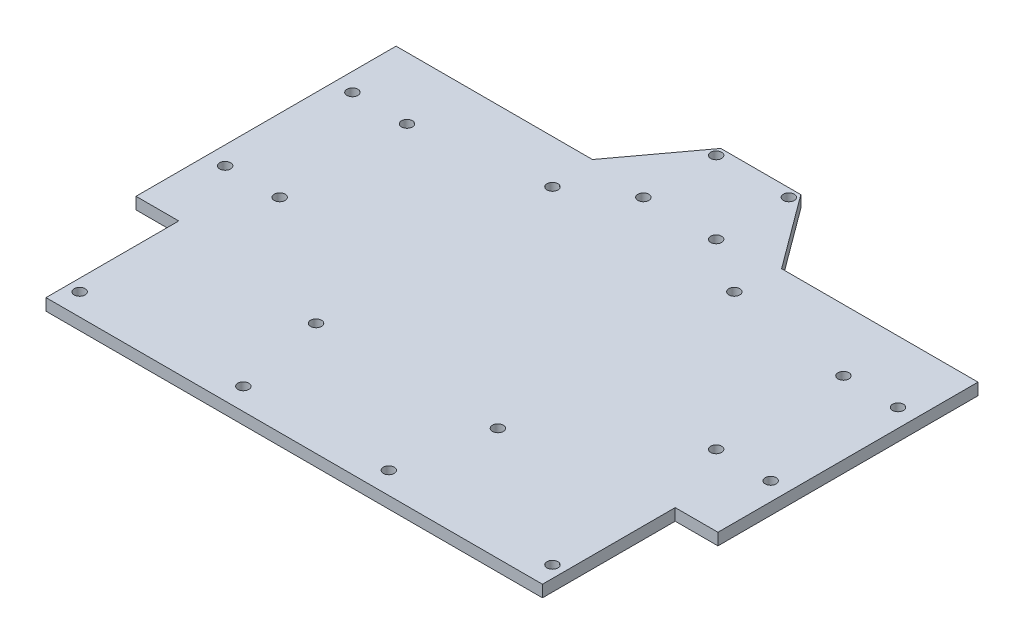
ISO-10303-21;
HEADER;
FILE_DESCRIPTION(('STEP AP214'),'2;1');
FILE_NAME('part.step','',(''),(''),'','','');
FILE_SCHEMA(('AUTOMOTIVE_DESIGN { 1 0 10303 214 1 1 1 1 }'));
ENDSEC;
DATA;
#1=APPLICATION_CONTEXT('core data for automotive mechanical design processes');
#2=APPLICATION_PROTOCOL_DEFINITION('international standard','automotive_design',2000,#1);
#3=PRODUCT_CONTEXT('',#1,'mechanical');
#4=PRODUCT('Part','Part','',(#3));
#5=PRODUCT_RELATED_PRODUCT_CATEGORY('part','',(#4));
#6=PRODUCT_DEFINITION_FORMATION('','',#4);
#7=PRODUCT_DEFINITION_CONTEXT('part definition',#1,'design');
#8=PRODUCT_DEFINITION('design','',#6,#7);
#9=PRODUCT_DEFINITION_SHAPE('','',#8);
#10=(LENGTH_UNIT() NAMED_UNIT(*) SI_UNIT(.MILLI.,.METRE.));
#11=(NAMED_UNIT(*) PLANE_ANGLE_UNIT() SI_UNIT($,.RADIAN.));
#12=(NAMED_UNIT(*) SI_UNIT($,.STERADIAN.) SOLID_ANGLE_UNIT());
#13=UNCERTAINTY_MEASURE_WITH_UNIT(LENGTH_MEASURE(1.E-05),#10,'distance_accuracy_value','');
#14=(GEOMETRIC_REPRESENTATION_CONTEXT(3) GLOBAL_UNCERTAINTY_ASSIGNED_CONTEXT((#13)) GLOBAL_UNIT_ASSIGNED_CONTEXT((#10,
#11,#12)) REPRESENTATION_CONTEXT('',''));
#15=CARTESIAN_POINT('',(0.,0.,0.));
#16=DIRECTION('',(0.,0.,1.));
#17=DIRECTION('',(1.,0.,0.));
#18=AXIS2_PLACEMENT_3D('',#15,#16,#17);
#19=CARTESIAN_POINT('',(0.,3.25,-35.75));
#20=DIRECTION('',(0.,0.,-1.));
#21=DIRECTION('',(-1.,0.,0.));
#22=AXIS2_PLACEMENT_3D('',#19,#20,#21);
#23=PLANE('',#22);
#24=DIRECTION('',(1.,0.,0.));
#25=VECTOR('',#24,1.);
#26=CARTESIAN_POINT('',(0.,0.,-35.75));
#27=LINE('',#26,#25);
#28=CARTESIAN_POINT('',(26.,0.,-35.75));
#29=VERTEX_POINT('',#28);
#30=CARTESIAN_POINT('',(80.,0.,-35.75));
#31=VERTEX_POINT('',#30);
#32=EDGE_CURVE('E185',#29,#31,#27,.T.);
#33=ORIENTED_EDGE('',*,*,#32,.F.);
#34=DIRECTION('',(0.,-1.,0.));
#35=VECTOR('',#34,1.);
#36=CARTESIAN_POINT('',(26.,3.25,-35.75));
#37=LINE('',#36,#35);
#38=CARTESIAN_POINT('',(26.,3.25,-35.75));
#39=VERTEX_POINT('',#38);
#40=EDGE_CURVE('E11',#39,#29,#37,.T.);
#41=ORIENTED_EDGE('',*,*,#40,.F.);
#42=DIRECTION('',(1.,0.,0.));
#43=VECTOR('',#42,1.);
#44=CARTESIAN_POINT('',(0.,3.25,-35.75));
#45=LINE('',#44,#43);
#46=CARTESIAN_POINT('',(80.,3.25,-35.75));
#47=VERTEX_POINT('',#46);
#48=EDGE_CURVE('E688',#39,#47,#45,.T.);
#49=ORIENTED_EDGE('',*,*,#48,.T.);
#50=DIRECTION('',(0.,-1.,0.));
#51=VECTOR('',#50,1.);
#52=CARTESIAN_POINT('',(80.,3.25,-35.75));
#53=LINE('',#52,#51);
#54=EDGE_CURVE('E54',#47,#31,#53,.T.);
#55=ORIENTED_EDGE('',*,*,#54,.T.);
#56=EDGE_LOOP('',(#33,#41,#49,#55));
#57=FACE_BOUND('',#56,.T.);
#58=ADVANCED_FACE('F37',(#57),#23,.T.);
#59=CARTESIAN_POINT('',(33.8998168733713,3.25,-25.0661945919675));
#60=DIRECTION('',(0.804064926863355,0.,-0.594541498457616));
#61=DIRECTION('',(-0.594541498457616,0.,-0.804064926863355));
#62=AXIS2_PLACEMENT_3D('',#59,#60,#61);
#63=PLANE('',#62);
#64=DIRECTION('',(0.594541498457616,0.,0.804064926863355));
#65=VECTOR('',#64,1.);
#66=CARTESIAN_POINT('',(33.8998168733713,0.,-25.0661945919675));
#67=LINE('',#66,#65);
#68=CARTESIAN_POINT('',(11.,0.,-56.0361767164099));
#69=VERTEX_POINT('',#68);
#70=EDGE_CURVE('E182',#69,#29,#67,.T.);
#71=ORIENTED_EDGE('',*,*,#70,.F.);
#72=DIRECTION('',(0.,-1.,0.));
#73=VECTOR('',#72,1.);
#74=CARTESIAN_POINT('',(11.,3.25,-56.0361767164099));
#75=LINE('',#74,#73);
#76=CARTESIAN_POINT('',(11.,3.25,-56.0361767164099));
#77=VERTEX_POINT('',#76);
#78=EDGE_CURVE('E46',#77,#69,#75,.T.);
#79=ORIENTED_EDGE('',*,*,#78,.F.);
#80=DIRECTION('',(0.594541498457616,0.,0.804064926863355));
#81=VECTOR('',#80,1.);
#82=CARTESIAN_POINT('',(33.8998168733713,3.25,-25.0661945919675));
#83=LINE('',#82,#81);
#84=EDGE_CURVE('E686',#77,#39,#83,.T.);
#85=ORIENTED_EDGE('',*,*,#84,.T.);
#86=ORIENTED_EDGE('',*,*,#40,.T.);
#87=EDGE_LOOP('',(#71,#79,#85,#86));
#88=FACE_BOUND('',#87,.T.);
#89=ADVANCED_FACE('F183',(#88),#63,.T.);
#90=CARTESIAN_POINT('',(0.,3.25,-56.0361767164099));
#91=DIRECTION('',(0.,0.,-1.));
#92=DIRECTION('',(-1.,0.,0.));
#93=AXIS2_PLACEMENT_3D('',#90,#91,#92);
#94=PLANE('',#93);
#95=DIRECTION('',(1.,0.,0.));
#96=VECTOR('',#95,1.);
#97=CARTESIAN_POINT('',(0.,0.,-56.0361767164099));
#98=LINE('',#97,#96);
#99=CARTESIAN_POINT('',(-11.,0.,-56.0361767164099));
#100=VERTEX_POINT('',#99);
#101=EDGE_CURVE('E174',#100,#69,#98,.T.);
#102=ORIENTED_EDGE('',*,*,#101,.F.);
#103=DIRECTION('',(0.,-1.,0.));
#104=VECTOR('',#103,1.);
#105=CARTESIAN_POINT('',(-11.,3.25,-56.0361767164099));
#106=LINE('',#105,#104);
#107=CARTESIAN_POINT('',(-11.,3.25,-56.0361767164099));
#108=VERTEX_POINT('',#107);
#109=EDGE_CURVE('E167',#108,#100,#106,.T.);
#110=ORIENTED_EDGE('',*,*,#109,.F.);
#111=DIRECTION('',(1.,0.,0.));
#112=VECTOR('',#111,1.);
#113=CARTESIAN_POINT('',(0.,3.25,-56.0361767164099));
#114=LINE('',#113,#112);
#115=EDGE_CURVE('E177',#108,#77,#114,.T.);
#116=ORIENTED_EDGE('',*,*,#115,.T.);
#117=ORIENTED_EDGE('',*,*,#78,.T.);
#118=EDGE_LOOP('',(#102,#110,#116,#117));
#119=FACE_BOUND('',#118,.T.);
#120=ADVANCED_FACE('F172',(#119),#94,.T.);
#121=CARTESIAN_POINT('',(-33.8998168733714,3.25,-25.0661945919675));
#122=DIRECTION('',(-0.804064926863356,0.,-0.594541498457615));
#123=DIRECTION('',(-0.594541498457615,0.,0.804064926863356));
#124=AXIS2_PLACEMENT_3D('',#121,#122,#123);
#125=PLANE('',#124);
#126=DIRECTION('',(0.594541498457615,0.,-0.804064926863356));
#127=VECTOR('',#126,1.);
#128=CARTESIAN_POINT('',(-33.8998168733714,0.,-25.0661945919675));
#129=LINE('',#128,#127);
#130=CARTESIAN_POINT('',(-26.,0.,-35.75));
#131=VERTEX_POINT('',#130);
#132=EDGE_CURVE('E190',#131,#100,#129,.T.);
#133=ORIENTED_EDGE('',*,*,#132,.F.);
#134=DIRECTION('',(0.,-1.,0.));
#135=VECTOR('',#134,1.);
#136=CARTESIAN_POINT('',(-26.,3.25,-35.75));
#137=LINE('',#136,#135);
#138=CARTESIAN_POINT('',(-26.,3.25,-35.75));
#139=VERTEX_POINT('',#138);
#140=EDGE_CURVE('E165',#139,#131,#137,.T.);
#141=ORIENTED_EDGE('',*,*,#140,.F.);
#142=DIRECTION('',(0.594541498457615,0.,-0.804064926863356));
#143=VECTOR('',#142,1.);
#144=CARTESIAN_POINT('',(-33.8998168733714,3.25,-25.0661945919675));
#145=LINE('',#144,#143);
#146=EDGE_CURVE('E670',#139,#108,#145,.T.);
#147=ORIENTED_EDGE('',*,*,#146,.T.);
#148=ORIENTED_EDGE('',*,*,#109,.T.);
#149=EDGE_LOOP('',(#133,#141,#147,#148));
#150=FACE_BOUND('',#149,.T.);
#151=ADVANCED_FACE('F629',(#150),#125,.T.);
#152=CARTESIAN_POINT('',(0.,3.25,-35.75));
#153=DIRECTION('',(0.,0.,-1.));
#154=DIRECTION('',(-1.,0.,0.));
#155=AXIS2_PLACEMENT_3D('',#152,#153,#154);
#156=PLANE('',#155);
#157=DIRECTION('',(1.,0.,0.));
#158=VECTOR('',#157,1.);
#159=CARTESIAN_POINT('',(0.,0.,-35.75));
#160=LINE('',#159,#158);
#161=CARTESIAN_POINT('',(-80.,0.,-35.75));
#162=VERTEX_POINT('',#161);
#163=EDGE_CURVE('E192',#162,#131,#160,.T.);
#164=ORIENTED_EDGE('',*,*,#163,.F.);
#165=DIRECTION('',(0.,-1.,0.));
#166=VECTOR('',#165,1.);
#167=CARTESIAN_POINT('',(-80.,3.25,-35.75));
#168=LINE('',#167,#166);
#169=CARTESIAN_POINT('',(-80.,3.25,-35.75));
#170=VERTEX_POINT('',#169);
#171=EDGE_CURVE('E163',#170,#162,#168,.T.);
#172=ORIENTED_EDGE('',*,*,#171,.F.);
#173=DIRECTION('',(1.,0.,0.));
#174=VECTOR('',#173,1.);
#175=CARTESIAN_POINT('',(0.,3.25,-35.75));
#176=LINE('',#175,#174);
#177=EDGE_CURVE('E667',#170,#139,#176,.T.);
#178=ORIENTED_EDGE('',*,*,#177,.T.);
#179=ORIENTED_EDGE('',*,*,#140,.T.);
#180=EDGE_LOOP('',(#164,#172,#178,#179));
#181=FACE_BOUND('',#180,.T.);
#182=ADVANCED_FACE('F619',(#181),#156,.T.);
#183=CARTESIAN_POINT('',(-80.,3.25,0.));
#184=DIRECTION('',(1.,0.,0.));
#185=DIRECTION('',(0.,0.,-1.));
#186=AXIS2_PLACEMENT_3D('',#183,#184,#185);
#187=PLANE('',#186);
#188=DIRECTION('',(0.,0.,1.));
#189=VECTOR('',#188,1.);
#190=CARTESIAN_POINT('',(-80.,0.,0.));
#191=LINE('',#190,#189);
#192=CARTESIAN_POINT('',(-80.,0.,35.75));
#193=VERTEX_POINT('',#192);
#194=EDGE_CURVE('E197',#162,#193,#191,.T.);
#195=ORIENTED_EDGE('',*,*,#194,.T.);
#196=DIRECTION('',(0.,-1.,0.));
#197=VECTOR('',#196,1.);
#198=CARTESIAN_POINT('',(-80.,3.25,35.75));
#199=LINE('',#198,#197);
#200=CARTESIAN_POINT('',(-80.,3.25,35.75));
#201=VERTEX_POINT('',#200);
#202=EDGE_CURVE('E160',#201,#193,#199,.T.);
#203=ORIENTED_EDGE('',*,*,#202,.F.);
#204=DIRECTION('',(0.,0.,1.));
#205=VECTOR('',#204,1.);
#206=CARTESIAN_POINT('',(-80.,3.25,0.));
#207=LINE('',#206,#205);
#208=EDGE_CURVE('E669',#170,#201,#207,.T.);
#209=ORIENTED_EDGE('',*,*,#208,.F.);
#210=ORIENTED_EDGE('',*,*,#171,.T.);
#211=EDGE_LOOP('',(#195,#203,#209,#210));
#212=FACE_BOUND('',#211,.T.);
#213=ADVANCED_FACE('F609',(#212),#187,.F.);
#214=CARTESIAN_POINT('',(0.,3.25,35.75));
#215=DIRECTION('',(0.,0.,-1.));
#216=DIRECTION('',(-1.,0.,0.));
#217=AXIS2_PLACEMENT_3D('',#214,#215,#216);
#218=PLANE('',#217);
#219=DIRECTION('',(1.,0.,0.));
#220=VECTOR('',#219,1.);
#221=CARTESIAN_POINT('',(0.,0.,35.75));
#222=LINE('',#221,#220);
#223=CARTESIAN_POINT('',(-68.25,0.,35.75));
#224=VERTEX_POINT('',#223);
#225=EDGE_CURVE('E200',#193,#224,#222,.T.);
#226=ORIENTED_EDGE('',*,*,#225,.T.);
#227=DIRECTION('',(0.,-1.,0.));
#228=VECTOR('',#227,1.);
#229=CARTESIAN_POINT('',(-68.25,3.25,35.75));
#230=LINE('',#229,#228);
#231=CARTESIAN_POINT('',(-68.25,3.25,35.75));
#232=VERTEX_POINT('',#231);
#233=EDGE_CURVE('E158',#232,#224,#230,.T.);
#234=ORIENTED_EDGE('',*,*,#233,.F.);
#235=DIRECTION('',(1.,0.,0.));
#236=VECTOR('',#235,1.);
#237=CARTESIAN_POINT('',(0.,3.25,35.75));
#238=LINE('',#237,#236);
#239=EDGE_CURVE('E672',#201,#232,#238,.T.);
#240=ORIENTED_EDGE('',*,*,#239,.F.);
#241=ORIENTED_EDGE('',*,*,#202,.T.);
#242=EDGE_LOOP('',(#226,#234,#240,#241));
#243=FACE_BOUND('',#242,.T.);
#244=ADVANCED_FACE('F599',(#243),#218,.F.);
#245=CARTESIAN_POINT('',(-68.25,3.25,0.));
#246=DIRECTION('',(-1.,0.,0.));
#247=DIRECTION('',(0.,0.,1.));
#248=AXIS2_PLACEMENT_3D('',#245,#246,#247);
#249=PLANE('',#248);
#250=DIRECTION('',(0.,0.,-1.));
#251=VECTOR('',#250,1.);
#252=CARTESIAN_POINT('',(-68.25,0.,0.));
#253=LINE('',#252,#251);
#254=CARTESIAN_POINT('',(-68.25,0.,72.25));
#255=VERTEX_POINT('',#254);
#256=EDGE_CURVE('E203',#255,#224,#253,.T.);
#257=ORIENTED_EDGE('',*,*,#256,.F.);
#258=DIRECTION('',(0.,-1.,0.));
#259=VECTOR('',#258,1.);
#260=CARTESIAN_POINT('',(-68.25,3.25,72.25));
#261=LINE('',#260,#259);
#262=CARTESIAN_POINT('',(-68.25,3.25,72.25));
#263=VERTEX_POINT('',#262);
#264=EDGE_CURVE('E152',#263,#255,#261,.T.);
#265=ORIENTED_EDGE('',*,*,#264,.F.);
#266=DIRECTION('',(0.,0.,-1.));
#267=VECTOR('',#266,1.);
#268=CARTESIAN_POINT('',(-68.25,3.25,0.));
#269=LINE('',#268,#267);
#270=EDGE_CURVE('E678',#263,#232,#269,.T.);
#271=ORIENTED_EDGE('',*,*,#270,.T.);
#272=ORIENTED_EDGE('',*,*,#233,.T.);
#273=EDGE_LOOP('',(#257,#265,#271,#272));
#274=FACE_BOUND('',#273,.T.);
#275=ADVANCED_FACE('F589',(#274),#249,.T.);
#276=CARTESIAN_POINT('',(0.,3.25,72.25));
#277=DIRECTION('',(0.,0.,-1.));
#278=DIRECTION('',(-1.,0.,0.));
#279=AXIS2_PLACEMENT_3D('',#276,#277,#278);
#280=PLANE('',#279);
#281=DIRECTION('',(1.,0.,0.));
#282=VECTOR('',#281,1.);
#283=CARTESIAN_POINT('',(0.,0.,72.25));
#284=LINE('',#283,#282);
#285=CARTESIAN_POINT('',(68.25,0.,72.25));
#286=VERTEX_POINT('',#285);
#287=EDGE_CURVE('E206',#255,#286,#284,.T.);
#288=ORIENTED_EDGE('',*,*,#287,.T.);
#289=DIRECTION('',(0.,-1.,0.));
#290=VECTOR('',#289,1.);
#291=CARTESIAN_POINT('',(68.25,3.25,72.25));
#292=LINE('',#291,#290);
#293=CARTESIAN_POINT('',(68.25,3.25,72.25));
#294=VERTEX_POINT('',#293);
#295=EDGE_CURVE('E150',#294,#286,#292,.T.);
#296=ORIENTED_EDGE('',*,*,#295,.F.);
#297=DIRECTION('',(1.,0.,0.));
#298=VECTOR('',#297,1.);
#299=CARTESIAN_POINT('',(0.,3.25,72.25));
#300=LINE('',#299,#298);
#301=EDGE_CURVE('E143',#263,#294,#300,.T.);
#302=ORIENTED_EDGE('',*,*,#301,.F.);
#303=ORIENTED_EDGE('',*,*,#264,.T.);
#304=EDGE_LOOP('',(#288,#296,#302,#303));
#305=FACE_BOUND('',#304,.T.);
#306=ADVANCED_FACE('F580',(#305),#280,.F.);
#307=CARTESIAN_POINT('',(68.25,3.25,0.));
#308=DIRECTION('',(-1.,0.,0.));
#309=DIRECTION('',(0.,0.,1.));
#310=AXIS2_PLACEMENT_3D('',#307,#308,#309);
#311=PLANE('',#310);
#312=DIRECTION('',(0.,0.,-1.));
#313=VECTOR('',#312,1.);
#314=CARTESIAN_POINT('',(68.25,0.,0.));
#315=LINE('',#314,#313);
#316=CARTESIAN_POINT('',(68.25,0.,35.75));
#317=VERTEX_POINT('',#316);
#318=EDGE_CURVE('E149',#286,#317,#315,.T.);
#319=ORIENTED_EDGE('',*,*,#318,.T.);
#320=DIRECTION('',(0.,-1.,0.));
#321=VECTOR('',#320,1.);
#322=CARTESIAN_POINT('',(68.25,3.25,35.75));
#323=LINE('',#322,#321);
#324=CARTESIAN_POINT('',(68.25,3.25,35.75));
#325=VERTEX_POINT('',#324);
#326=EDGE_CURVE('E132',#325,#317,#323,.T.);
#327=ORIENTED_EDGE('',*,*,#326,.F.);
#328=DIRECTION('',(0.,0.,-1.));
#329=VECTOR('',#328,1.);
#330=CARTESIAN_POINT('',(68.25,3.25,0.));
#331=LINE('',#330,#329);
#332=EDGE_CURVE('E137',#294,#325,#331,.T.);
#333=ORIENTED_EDGE('',*,*,#332,.F.);
#334=ORIENTED_EDGE('',*,*,#295,.T.);
#335=EDGE_LOOP('',(#319,#327,#333,#334));
#336=FACE_BOUND('',#335,.T.);
#337=ADVANCED_FACE('F148',(#336),#311,.F.);
#338=CARTESIAN_POINT('',(0.,3.25,35.75));
#339=DIRECTION('',(0.,0.,-1.));
#340=DIRECTION('',(-1.,0.,0.));
#341=AXIS2_PLACEMENT_3D('',#338,#339,#340);
#342=PLANE('',#341);
#343=DIRECTION('',(1.,0.,0.));
#344=VECTOR('',#343,1.);
#345=CARTESIAN_POINT('',(0.,0.,35.75));
#346=LINE('',#345,#344);
#347=CARTESIAN_POINT('',(80.,0.,35.75));
#348=VERTEX_POINT('',#347);
#349=EDGE_CURVE('E210',#317,#348,#346,.T.);
#350=ORIENTED_EDGE('',*,*,#349,.T.);
#351=DIRECTION('',(0.,-1.,0.));
#352=VECTOR('',#351,1.);
#353=CARTESIAN_POINT('',(80.,3.25,35.75));
#354=LINE('',#353,#352);
#355=CARTESIAN_POINT('',(80.,3.25,35.75));
#356=VERTEX_POINT('',#355);
#357=EDGE_CURVE('E92',#356,#348,#354,.T.);
#358=ORIENTED_EDGE('',*,*,#357,.F.);
#359=DIRECTION('',(1.,0.,0.));
#360=VECTOR('',#359,1.);
#361=CARTESIAN_POINT('',(0.,3.25,35.75));
#362=LINE('',#361,#360);
#363=EDGE_CURVE('E128',#325,#356,#362,.T.);
#364=ORIENTED_EDGE('',*,*,#363,.F.);
#365=ORIENTED_EDGE('',*,*,#326,.T.);
#366=EDGE_LOOP('',(#350,#358,#364,#365));
#367=FACE_BOUND('',#366,.T.);
#368=ADVANCED_FACE('F130',(#367),#342,.F.);
#369=CARTESIAN_POINT('',(-10.,3.25,-33.75));
#370=DIRECTION('',(0.,-1.,0.));
#371=DIRECTION('',(0.,0.,-1.));
#372=AXIS2_PLACEMENT_3D('',#369,#370,#371);
#373=CYLINDRICAL_SURFACE('',#372,1.50250000000001);
#374=CARTESIAN_POINT('',(-10.,3.25,-33.75));
#375=DIRECTION('',(0.,1.,0.));
#376=DIRECTION('',(0.,0.,1.));
#377=AXIS2_PLACEMENT_3D('',#374,#375,#376);
#378=CIRCLE('',#377,1.50250000000001);
#379=CARTESIAN_POINT('',(-10.,3.25,-32.2475));
#380=VERTEX_POINT('',#379);
#381=EDGE_CURVE('E690',#380,#380,#378,.T.);
#382=ORIENTED_EDGE('',*,*,#381,.T.);
#383=EDGE_LOOP('',(#382));
#384=FACE_BOUND('',#383,.T.);
#385=CARTESIAN_POINT('',(-10.,0.,-33.75));
#386=DIRECTION('',(0.,1.,0.));
#387=DIRECTION('',(0.,0.,1.));
#388=AXIS2_PLACEMENT_3D('',#385,#386,#387);
#389=CIRCLE('',#388,1.50250000000001);
#390=CARTESIAN_POINT('',(-10.,0.,-32.2475));
#391=VERTEX_POINT('',#390);
#392=EDGE_CURVE('E274',#391,#391,#389,.T.);
#393=ORIENTED_EDGE('',*,*,#392,.F.);
#394=EDGE_LOOP('',(#393));
#395=FACE_BOUND('',#394,.T.);
#396=ADVANCED_FACE('F297',(#384,#395),#373,.F.);
#397=CARTESIAN_POINT('',(9.99999999999999,3.25,-33.75));
#398=DIRECTION('',(0.,-1.,0.));
#399=DIRECTION('',(0.,0.,-1.));
#400=AXIS2_PLACEMENT_3D('',#397,#398,#399);
#401=CYLINDRICAL_SURFACE('',#400,1.50250000000001);
#402=CARTESIAN_POINT('',(9.99999999999999,3.25,-33.75));
#403=DIRECTION('',(0.,1.,0.));
#404=DIRECTION('',(0.,0.,1.));
#405=AXIS2_PLACEMENT_3D('',#402,#403,#404);
#406=CIRCLE('',#405,1.50250000000001);
#407=CARTESIAN_POINT('',(9.99999999999999,3.25,-32.2475));
#408=VERTEX_POINT('',#407);
#409=EDGE_CURVE('E693',#408,#408,#406,.T.);
#410=ORIENTED_EDGE('',*,*,#409,.T.);
#411=EDGE_LOOP('',(#410));
#412=FACE_BOUND('',#411,.T.);
#413=CARTESIAN_POINT('',(9.99999999999999,0.,-33.75));
#414=DIRECTION('',(0.,1.,0.));
#415=DIRECTION('',(0.,0.,1.));
#416=AXIS2_PLACEMENT_3D('',#413,#414,#415);
#417=CIRCLE('',#416,1.50250000000001);
#418=CARTESIAN_POINT('',(9.99999999999999,0.,-32.2475));
#419=VERTEX_POINT('',#418);
#420=EDGE_CURVE('E271',#419,#419,#417,.T.);
#421=ORIENTED_EDGE('',*,*,#420,.F.);
#422=EDGE_LOOP('',(#421));
#423=FACE_BOUND('',#422,.T.);
#424=ADVANCED_FACE('F300',(#412,#423),#401,.F.);
#425=CARTESIAN_POINT('',(-10.0000000000001,3.25,-53.75));
#426=DIRECTION('',(0.,-1.,0.));
#427=DIRECTION('',(0.,0.,-1.));
#428=AXIS2_PLACEMENT_3D('',#425,#426,#427);
#429=CYLINDRICAL_SURFACE('',#428,1.5025);
#430=CARTESIAN_POINT('',(-10.0000000000001,3.25,-53.75));
#431=DIRECTION('',(0.,1.,0.));
#432=DIRECTION('',(0.,0.,1.));
#433=AXIS2_PLACEMENT_3D('',#430,#431,#432);
#434=CIRCLE('',#433,1.5025);
#435=CARTESIAN_POINT('',(-10.0000000000001,3.25,-52.2475));
#436=VERTEX_POINT('',#435);
#437=EDGE_CURVE('E696',#436,#436,#434,.T.);
#438=ORIENTED_EDGE('',*,*,#437,.T.);
#439=EDGE_LOOP('',(#438));
#440=FACE_BOUND('',#439,.T.);
#441=CARTESIAN_POINT('',(-10.0000000000001,0.,-53.75));
#442=DIRECTION('',(0.,1.,0.));
#443=DIRECTION('',(0.,0.,1.));
#444=AXIS2_PLACEMENT_3D('',#441,#442,#443);
#445=CIRCLE('',#444,1.5025);
#446=CARTESIAN_POINT('',(-10.0000000000001,0.,-52.2475));
#447=VERTEX_POINT('',#446);
#448=EDGE_CURVE('E268',#447,#447,#445,.T.);
#449=ORIENTED_EDGE('',*,*,#448,.F.);
#450=EDGE_LOOP('',(#449));
#451=FACE_BOUND('',#450,.T.);
#452=ADVANCED_FACE('F304',(#440,#451),#429,.F.);
#453=CARTESIAN_POINT('',(9.99999999999993,3.25,-53.75));
#454=DIRECTION('',(0.,-1.,0.));
#455=DIRECTION('',(0.,0.,-1.));
#456=AXIS2_PLACEMENT_3D('',#453,#454,#455);
#457=CYLINDRICAL_SURFACE('',#456,1.5025);
#458=CARTESIAN_POINT('',(9.99999999999993,3.25,-53.75));
#459=DIRECTION('',(0.,1.,0.));
#460=DIRECTION('',(0.,0.,1.));
#461=AXIS2_PLACEMENT_3D('',#458,#459,#460);
#462=CIRCLE('',#461,1.5025);
#463=CARTESIAN_POINT('',(9.99999999999993,3.25,-52.2475));
#464=VERTEX_POINT('',#463);
#465=EDGE_CURVE('E699',#464,#464,#462,.T.);
#466=ORIENTED_EDGE('',*,*,#465,.T.);
#467=EDGE_LOOP('',(#466));
#468=FACE_BOUND('',#467,.T.);
#469=CARTESIAN_POINT('',(9.99999999999993,0.,-53.75));
#470=DIRECTION('',(0.,1.,0.));
#471=DIRECTION('',(0.,0.,1.));
#472=AXIS2_PLACEMENT_3D('',#469,#470,#471);
#473=CIRCLE('',#472,1.5025);
#474=CARTESIAN_POINT('',(9.99999999999993,0.,-52.2475));
#475=VERTEX_POINT('',#474);
#476=EDGE_CURVE('E265',#475,#475,#473,.T.);
#477=ORIENTED_EDGE('',*,*,#476,.F.);
#478=EDGE_LOOP('',(#477));
#479=FACE_BOUND('',#478,.T.);
#480=ADVANCED_FACE('F308',(#468,#479),#457,.F.);
#481=CARTESIAN_POINT('',(-25.,3.25,-23.75));
#482=DIRECTION('',(0.,-1.,0.));
#483=DIRECTION('',(0.,0.,-1.));
#484=AXIS2_PLACEMENT_3D('',#481,#482,#483);
#485=CYLINDRICAL_SURFACE('',#484,1.50250000000001);
#486=CARTESIAN_POINT('',(-25.,3.25,-23.75));
#487=DIRECTION('',(0.,1.,0.));
#488=DIRECTION('',(0.,0.,1.));
#489=AXIS2_PLACEMENT_3D('',#486,#487,#488);
#490=CIRCLE('',#489,1.50250000000001);
#491=CARTESIAN_POINT('',(-25.,3.25,-22.2475));
#492=VERTEX_POINT('',#491);
#493=EDGE_CURVE('E702',#492,#492,#490,.T.);
#494=ORIENTED_EDGE('',*,*,#493,.T.);
#495=EDGE_LOOP('',(#494));
#496=FACE_BOUND('',#495,.T.);
#497=CARTESIAN_POINT('',(-25.,0.,-23.75));
#498=DIRECTION('',(0.,1.,0.));
#499=DIRECTION('',(0.,0.,1.));
#500=AXIS2_PLACEMENT_3D('',#497,#498,#499);
#501=CIRCLE('',#500,1.50250000000001);
#502=CARTESIAN_POINT('',(-25.,0.,-22.2475));
#503=VERTEX_POINT('',#502);
#504=EDGE_CURVE('E262',#503,#503,#501,.T.);
#505=ORIENTED_EDGE('',*,*,#504,.F.);
#506=EDGE_LOOP('',(#505));
#507=FACE_BOUND('',#506,.T.);
#508=ADVANCED_FACE('F312',(#496,#507),#485,.F.);
#509=CARTESIAN_POINT('',(25.,3.25,-23.75));
#510=DIRECTION('',(0.,-1.,0.));
#511=DIRECTION('',(0.,0.,-1.));
#512=AXIS2_PLACEMENT_3D('',#509,#510,#511);
#513=CYLINDRICAL_SURFACE('',#512,1.50250000000001);
#514=CARTESIAN_POINT('',(25.,3.25,-23.75));
#515=DIRECTION('',(0.,1.,0.));
#516=DIRECTION('',(0.,0.,1.));
#517=AXIS2_PLACEMENT_3D('',#514,#515,#516);
#518=CIRCLE('',#517,1.50250000000001);
#519=CARTESIAN_POINT('',(25.,3.25,-22.2475));
#520=VERTEX_POINT('',#519);
#521=EDGE_CURVE('E705',#520,#520,#518,.T.);
#522=ORIENTED_EDGE('',*,*,#521,.T.);
#523=EDGE_LOOP('',(#522));
#524=FACE_BOUND('',#523,.T.);
#525=CARTESIAN_POINT('',(25.,0.,-23.75));
#526=DIRECTION('',(0.,1.,0.));
#527=DIRECTION('',(0.,0.,1.));
#528=AXIS2_PLACEMENT_3D('',#525,#526,#527);
#529=CIRCLE('',#528,1.50250000000001);
#530=CARTESIAN_POINT('',(25.,0.,-22.2475));
#531=VERTEX_POINT('',#530);
#532=EDGE_CURVE('E259',#531,#531,#529,.T.);
#533=ORIENTED_EDGE('',*,*,#532,.F.);
#534=EDGE_LOOP('',(#533));
#535=FACE_BOUND('',#534,.T.);
#536=ADVANCED_FACE('F316',(#524,#535),#513,.F.);
#537=CARTESIAN_POINT('',(-59.9999999999999,3.25,-18.75));
#538=DIRECTION('',(0.,-1.,0.));
#539=DIRECTION('',(0.,0.,-1.));
#540=AXIS2_PLACEMENT_3D('',#537,#538,#539);
#541=CYLINDRICAL_SURFACE('',#540,1.50250000000001);
#542=CARTESIAN_POINT('',(-59.9999999999999,3.25,-18.75));
#543=DIRECTION('',(0.,1.,0.));
#544=DIRECTION('',(0.,0.,1.));
#545=AXIS2_PLACEMENT_3D('',#542,#543,#544);
#546=CIRCLE('',#545,1.50250000000001);
#547=CARTESIAN_POINT('',(-59.9999999999999,3.25,-17.2475));
#548=VERTEX_POINT('',#547);
#549=EDGE_CURVE('E708',#548,#548,#546,.T.);
#550=ORIENTED_EDGE('',*,*,#549,.T.);
#551=EDGE_LOOP('',(#550));
#552=FACE_BOUND('',#551,.T.);
#553=CARTESIAN_POINT('',(-59.9999999999999,0.,-18.75));
#554=DIRECTION('',(0.,1.,0.));
#555=DIRECTION('',(0.,0.,1.));
#556=AXIS2_PLACEMENT_3D('',#553,#554,#555);
#557=CIRCLE('',#556,1.50250000000001);
#558=CARTESIAN_POINT('',(-59.9999999999999,0.,-17.2475));
#559=VERTEX_POINT('',#558);
#560=EDGE_CURVE('E256',#559,#559,#557,.T.);
#561=ORIENTED_EDGE('',*,*,#560,.F.);
#562=EDGE_LOOP('',(#561));
#563=FACE_BOUND('',#562,.T.);
#564=ADVANCED_FACE('F320',(#552,#563),#541,.F.);
#565=CARTESIAN_POINT('',(60.0000000000001,3.25,-18.75));
#566=DIRECTION('',(0.,-1.,0.));
#567=DIRECTION('',(0.,0.,-1.));
#568=AXIS2_PLACEMENT_3D('',#565,#566,#567);
#569=CYLINDRICAL_SURFACE('',#568,1.50250000000001);
#570=CARTESIAN_POINT('',(60.0000000000001,3.25,-18.75));
#571=DIRECTION('',(0.,1.,0.));
#572=DIRECTION('',(0.,0.,1.));
#573=AXIS2_PLACEMENT_3D('',#570,#571,#572);
#574=CIRCLE('',#573,1.50250000000001);
#575=CARTESIAN_POINT('',(60.0000000000001,3.25,-17.2475));
#576=VERTEX_POINT('',#575);
#577=EDGE_CURVE('E711',#576,#576,#574,.T.);
#578=ORIENTED_EDGE('',*,*,#577,.T.);
#579=EDGE_LOOP('',(#578));
#580=FACE_BOUND('',#579,.T.);
#581=CARTESIAN_POINT('',(60.0000000000001,0.,-18.75));
#582=DIRECTION('',(0.,1.,0.));
#583=DIRECTION('',(0.,0.,1.));
#584=AXIS2_PLACEMENT_3D('',#581,#582,#583);
#585=CIRCLE('',#584,1.50250000000001);
#586=CARTESIAN_POINT('',(60.0000000000001,0.,-17.2475));
#587=VERTEX_POINT('',#586);
#588=EDGE_CURVE('E253',#587,#587,#585,.T.);
#589=ORIENTED_EDGE('',*,*,#588,.F.);
#590=EDGE_LOOP('',(#589));
#591=FACE_BOUND('',#590,.T.);
#592=ADVANCED_FACE('F324',(#580,#591),#569,.F.);
#593=CARTESIAN_POINT('',(75.0000000000001,3.25,-18.75));
#594=DIRECTION('',(0.,-1.,0.));
#595=DIRECTION('',(0.,0.,-1.));
#596=AXIS2_PLACEMENT_3D('',#593,#594,#595);
#597=CYLINDRICAL_SURFACE('',#596,1.50250000000001);
#598=CARTESIAN_POINT('',(75.0000000000001,3.25,-18.75));
#599=DIRECTION('',(0.,1.,0.));
#600=DIRECTION('',(0.,0.,1.));
#601=AXIS2_PLACEMENT_3D('',#598,#599,#600);
#602=CIRCLE('',#601,1.50250000000001);
#603=CARTESIAN_POINT('',(75.0000000000001,3.25,-17.2475));
#604=VERTEX_POINT('',#603);
#605=EDGE_CURVE('E714',#604,#604,#602,.T.);
#606=ORIENTED_EDGE('',*,*,#605,.T.);
#607=EDGE_LOOP('',(#606));
#608=FACE_BOUND('',#607,.T.);
#609=CARTESIAN_POINT('',(75.0000000000001,0.,-18.75));
#610=DIRECTION('',(0.,1.,0.));
#611=DIRECTION('',(0.,0.,1.));
#612=AXIS2_PLACEMENT_3D('',#609,#610,#611);
#613=CIRCLE('',#612,1.50250000000001);
#614=CARTESIAN_POINT('',(75.0000000000001,0.,-17.2475));
#615=VERTEX_POINT('',#614);
#616=EDGE_CURVE('E250',#615,#615,#613,.T.);
#617=ORIENTED_EDGE('',*,*,#616,.F.);
#618=EDGE_LOOP('',(#617));
#619=FACE_BOUND('',#618,.T.);
#620=ADVANCED_FACE('F328',(#608,#619),#597,.F.);
#621=CARTESIAN_POINT('',(-59.9999999999995,3.25,16.25));
#622=DIRECTION('',(0.,-1.,0.));
#623=DIRECTION('',(0.,0.,-1.));
#624=AXIS2_PLACEMENT_3D('',#621,#622,#623);
#625=CYLINDRICAL_SURFACE('',#624,1.50250000000001);
#626=CARTESIAN_POINT('',(-59.9999999999995,3.25,16.25));
#627=DIRECTION('',(0.,1.,0.));
#628=DIRECTION('',(0.,0.,1.));
#629=AXIS2_PLACEMENT_3D('',#626,#627,#628);
#630=CIRCLE('',#629,1.50250000000001);
#631=CARTESIAN_POINT('',(-59.9999999999995,3.25,17.7525));
#632=VERTEX_POINT('',#631);
#633=EDGE_CURVE('E717',#632,#632,#630,.T.);
#634=ORIENTED_EDGE('',*,*,#633,.T.);
#635=EDGE_LOOP('',(#634));
#636=FACE_BOUND('',#635,.T.);
#637=CARTESIAN_POINT('',(-59.9999999999995,0.,16.25));
#638=DIRECTION('',(0.,1.,0.));
#639=DIRECTION('',(0.,0.,1.));
#640=AXIS2_PLACEMENT_3D('',#637,#638,#639);
#641=CIRCLE('',#640,1.50250000000001);
#642=CARTESIAN_POINT('',(-59.9999999999995,0.,17.7525));
#643=VERTEX_POINT('',#642);
#644=EDGE_CURVE('E247',#643,#643,#641,.T.);
#645=ORIENTED_EDGE('',*,*,#644,.F.);
#646=EDGE_LOOP('',(#645));
#647=FACE_BOUND('',#646,.T.);
#648=ADVANCED_FACE('F332',(#636,#647),#625,.F.);
#649=CARTESIAN_POINT('',(60.0000000000005,3.25,16.25));
#650=DIRECTION('',(0.,-1.,0.));
#651=DIRECTION('',(0.,0.,-1.));
#652=AXIS2_PLACEMENT_3D('',#649,#650,#651);
#653=CYLINDRICAL_SURFACE('',#652,1.50250000000001);
#654=CARTESIAN_POINT('',(60.0000000000005,3.25,16.25));
#655=DIRECTION('',(0.,1.,0.));
#656=DIRECTION('',(0.,0.,1.));
#657=AXIS2_PLACEMENT_3D('',#654,#655,#656);
#658=CIRCLE('',#657,1.50250000000001);
#659=CARTESIAN_POINT('',(60.0000000000005,3.25,17.7525));
#660=VERTEX_POINT('',#659);
#661=EDGE_CURVE('E720',#660,#660,#658,.T.);
#662=ORIENTED_EDGE('',*,*,#661,.T.);
#663=EDGE_LOOP('',(#662));
#664=FACE_BOUND('',#663,.T.);
#665=CARTESIAN_POINT('',(60.0000000000005,0.,16.25));
#666=DIRECTION('',(0.,1.,0.));
#667=DIRECTION('',(0.,0.,1.));
#668=AXIS2_PLACEMENT_3D('',#665,#666,#667);
#669=CIRCLE('',#668,1.50250000000001);
#670=CARTESIAN_POINT('',(60.0000000000005,0.,17.7525));
#671=VERTEX_POINT('',#670);
#672=EDGE_CURVE('E244',#671,#671,#669,.T.);
#673=ORIENTED_EDGE('',*,*,#672,.F.);
#674=EDGE_LOOP('',(#673));
#675=FACE_BOUND('',#674,.T.);
#676=ADVANCED_FACE('F336',(#664,#675),#653,.F.);
#677=CARTESIAN_POINT('',(75.0000000000005,3.25,16.25));
#678=DIRECTION('',(0.,-1.,0.));
#679=DIRECTION('',(0.,0.,-1.));
#680=AXIS2_PLACEMENT_3D('',#677,#678,#679);
#681=CYLINDRICAL_SURFACE('',#680,1.50250000000001);
#682=CARTESIAN_POINT('',(75.0000000000005,3.25,16.25));
#683=DIRECTION('',(0.,1.,0.));
#684=DIRECTION('',(0.,0.,1.));
#685=AXIS2_PLACEMENT_3D('',#682,#683,#684);
#686=CIRCLE('',#685,1.50250000000001);
#687=CARTESIAN_POINT('',(75.0000000000005,3.25,17.7525));
#688=VERTEX_POINT('',#687);
#689=EDGE_CURVE('E723',#688,#688,#686,.T.);
#690=ORIENTED_EDGE('',*,*,#689,.T.);
#691=EDGE_LOOP('',(#690));
#692=FACE_BOUND('',#691,.T.);
#693=CARTESIAN_POINT('',(75.0000000000005,0.,16.25));
#694=DIRECTION('',(0.,1.,0.));
#695=DIRECTION('',(0.,0.,1.));
#696=AXIS2_PLACEMENT_3D('',#693,#694,#695);
#697=CIRCLE('',#696,1.50250000000001);
#698=CARTESIAN_POINT('',(75.0000000000005,0.,17.7525));
#699=VERTEX_POINT('',#698);
#700=EDGE_CURVE('E241',#699,#699,#697,.T.);
#701=ORIENTED_EDGE('',*,*,#700,.F.);
#702=EDGE_LOOP('',(#701));
#703=FACE_BOUND('',#702,.T.);
#704=ADVANCED_FACE('F340',(#692,#703),#681,.F.);
#705=CARTESIAN_POINT('',(-24.9999999999993,3.25,41.25));
#706=DIRECTION('',(0.,-1.,0.));
#707=DIRECTION('',(0.,0.,-1.));
#708=AXIS2_PLACEMENT_3D('',#705,#706,#707);
#709=CYLINDRICAL_SURFACE('',#708,1.50250000000001);
#710=CARTESIAN_POINT('',(-24.9999999999993,3.25,41.25));
#711=DIRECTION('',(0.,1.,0.));
#712=DIRECTION('',(0.,0.,1.));
#713=AXIS2_PLACEMENT_3D('',#710,#711,#712);
#714=CIRCLE('',#713,1.50250000000001);
#715=CARTESIAN_POINT('',(-24.9999999999993,3.25,42.7525));
#716=VERTEX_POINT('',#715);
#717=EDGE_CURVE('E726',#716,#716,#714,.T.);
#718=ORIENTED_EDGE('',*,*,#717,.T.);
#719=EDGE_LOOP('',(#718));
#720=FACE_BOUND('',#719,.T.);
#721=CARTESIAN_POINT('',(-24.9999999999993,0.,41.25));
#722=DIRECTION('',(0.,1.,0.));
#723=DIRECTION('',(0.,0.,1.));
#724=AXIS2_PLACEMENT_3D('',#721,#722,#723);
#725=CIRCLE('',#724,1.50250000000001);
#726=CARTESIAN_POINT('',(-24.9999999999993,0.,42.7525));
#727=VERTEX_POINT('',#726);
#728=EDGE_CURVE('E238',#727,#727,#725,.T.);
#729=ORIENTED_EDGE('',*,*,#728,.F.);
#730=EDGE_LOOP('',(#729));
#731=FACE_BOUND('',#730,.T.);
#732=ADVANCED_FACE('F344',(#720,#731),#709,.F.);
#733=CARTESIAN_POINT('',(25.0000000000007,3.25,41.25));
#734=DIRECTION('',(0.,-1.,0.));
#735=DIRECTION('',(0.,0.,-1.));
#736=AXIS2_PLACEMENT_3D('',#733,#734,#735);
#737=CYLINDRICAL_SURFACE('',#736,1.50250000000001);
#738=CARTESIAN_POINT('',(25.0000000000007,3.25,41.25));
#739=DIRECTION('',(0.,1.,0.));
#740=DIRECTION('',(0.,0.,1.));
#741=AXIS2_PLACEMENT_3D('',#738,#739,#740);
#742=CIRCLE('',#741,1.50250000000001);
#743=CARTESIAN_POINT('',(25.0000000000007,3.25,42.7525));
#744=VERTEX_POINT('',#743);
#745=EDGE_CURVE('E729',#744,#744,#742,.T.);
#746=ORIENTED_EDGE('',*,*,#745,.T.);
#747=EDGE_LOOP('',(#746));
#748=FACE_BOUND('',#747,.T.);
#749=CARTESIAN_POINT('',(25.0000000000007,0.,41.25));
#750=DIRECTION('',(0.,1.,0.));
#751=DIRECTION('',(0.,0.,1.));
#752=AXIS2_PLACEMENT_3D('',#749,#750,#751);
#753=CIRCLE('',#752,1.50250000000001);
#754=CARTESIAN_POINT('',(25.0000000000007,0.,42.7525));
#755=VERTEX_POINT('',#754);
#756=EDGE_CURVE('E235',#755,#755,#753,.T.);
#757=ORIENTED_EDGE('',*,*,#756,.F.);
#758=EDGE_LOOP('',(#757));
#759=FACE_BOUND('',#758,.T.);
#760=ADVANCED_FACE('F348',(#748,#759),#737,.F.);
#761=CARTESIAN_POINT('',(-64.999999999999,3.25,66.25));
#762=DIRECTION('',(0.,-1.,0.));
#763=DIRECTION('',(0.,0.,-1.));
#764=AXIS2_PLACEMENT_3D('',#761,#762,#763);
#765=CYLINDRICAL_SURFACE('',#764,1.50250000000001);
#766=CARTESIAN_POINT('',(-64.999999999999,3.25,66.25));
#767=DIRECTION('',(0.,1.,0.));
#768=DIRECTION('',(0.,0.,1.));
#769=AXIS2_PLACEMENT_3D('',#766,#767,#768);
#770=CIRCLE('',#769,1.50250000000001);
#771=CARTESIAN_POINT('',(-64.999999999999,3.25,67.7525));
#772=VERTEX_POINT('',#771);
#773=EDGE_CURVE('E732',#772,#772,#770,.T.);
#774=ORIENTED_EDGE('',*,*,#773,.T.);
#775=EDGE_LOOP('',(#774));
#776=FACE_BOUND('',#775,.T.);
#777=CARTESIAN_POINT('',(-64.999999999999,0.,66.25));
#778=DIRECTION('',(0.,1.,0.));
#779=DIRECTION('',(0.,0.,1.));
#780=AXIS2_PLACEMENT_3D('',#777,#778,#779);
#781=CIRCLE('',#780,1.50250000000001);
#782=CARTESIAN_POINT('',(-64.999999999999,0.,67.7525));
#783=VERTEX_POINT('',#782);
#784=EDGE_CURVE('E232',#783,#783,#781,.T.);
#785=ORIENTED_EDGE('',*,*,#784,.F.);
#786=EDGE_LOOP('',(#785));
#787=FACE_BOUND('',#786,.T.);
#788=ADVANCED_FACE('F352',(#776,#787),#765,.F.);
#789=CARTESIAN_POINT('',(-19.999999999999,3.25,66.25));
#790=DIRECTION('',(0.,-1.,0.));
#791=DIRECTION('',(0.,0.,-1.));
#792=AXIS2_PLACEMENT_3D('',#789,#790,#791);
#793=CYLINDRICAL_SURFACE('',#792,1.50250000000001);
#794=CARTESIAN_POINT('',(-19.999999999999,3.25,66.25));
#795=DIRECTION('',(0.,1.,0.));
#796=DIRECTION('',(0.,0.,1.));
#797=AXIS2_PLACEMENT_3D('',#794,#795,#796);
#798=CIRCLE('',#797,1.50250000000001);
#799=CARTESIAN_POINT('',(-19.999999999999,3.25,67.7525));
#800=VERTEX_POINT('',#799);
#801=EDGE_CURVE('E735',#800,#800,#798,.T.);
#802=ORIENTED_EDGE('',*,*,#801,.T.);
#803=EDGE_LOOP('',(#802));
#804=FACE_BOUND('',#803,.T.);
#805=CARTESIAN_POINT('',(-19.999999999999,0.,66.25));
#806=DIRECTION('',(0.,1.,0.));
#807=DIRECTION('',(0.,0.,1.));
#808=AXIS2_PLACEMENT_3D('',#805,#806,#807);
#809=CIRCLE('',#808,1.50250000000001);
#810=CARTESIAN_POINT('',(-19.999999999999,0.,67.7525));
#811=VERTEX_POINT('',#810);
#812=EDGE_CURVE('E229',#811,#811,#809,.T.);
#813=ORIENTED_EDGE('',*,*,#812,.F.);
#814=EDGE_LOOP('',(#813));
#815=FACE_BOUND('',#814,.T.);
#816=ADVANCED_FACE('F356',(#804,#815),#793,.F.);
#817=CARTESIAN_POINT('',(20.000000000001,3.25,66.25));
#818=DIRECTION('',(0.,-1.,0.));
#819=DIRECTION('',(0.,0.,-1.));
#820=AXIS2_PLACEMENT_3D('',#817,#818,#819);
#821=CYLINDRICAL_SURFACE('',#820,1.50250000000001);
#822=CARTESIAN_POINT('',(20.000000000001,3.25,66.25));
#823=DIRECTION('',(0.,1.,0.));
#824=DIRECTION('',(0.,0.,1.));
#825=AXIS2_PLACEMENT_3D('',#822,#823,#824);
#826=CIRCLE('',#825,1.50250000000001);
#827=CARTESIAN_POINT('',(20.000000000001,3.25,67.7525));
#828=VERTEX_POINT('',#827);
#829=EDGE_CURVE('E738',#828,#828,#826,.T.);
#830=ORIENTED_EDGE('',*,*,#829,.T.);
#831=EDGE_LOOP('',(#830));
#832=FACE_BOUND('',#831,.T.);
#833=CARTESIAN_POINT('',(20.000000000001,0.,66.25));
#834=DIRECTION('',(0.,1.,0.));
#835=DIRECTION('',(0.,0.,1.));
#836=AXIS2_PLACEMENT_3D('',#833,#834,#835);
#837=CIRCLE('',#836,1.50250000000001);
#838=CARTESIAN_POINT('',(20.000000000001,0.,67.7525));
#839=VERTEX_POINT('',#838);
#840=EDGE_CURVE('E226',#839,#839,#837,.T.);
#841=ORIENTED_EDGE('',*,*,#840,.F.);
#842=EDGE_LOOP('',(#841));
#843=FACE_BOUND('',#842,.T.);
#844=ADVANCED_FACE('F360',(#832,#843),#821,.F.);
#845=CARTESIAN_POINT('',(65.000000000001,3.25,66.25));
#846=DIRECTION('',(0.,-1.,0.));
#847=DIRECTION('',(0.,0.,-1.));
#848=AXIS2_PLACEMENT_3D('',#845,#846,#847);
#849=CYLINDRICAL_SURFACE('',#848,1.50250000000001);
#850=CARTESIAN_POINT('',(65.000000000001,3.25,66.25));
#851=DIRECTION('',(0.,1.,0.));
#852=DIRECTION('',(0.,0.,1.));
#853=AXIS2_PLACEMENT_3D('',#850,#851,#852);
#854=CIRCLE('',#853,1.50250000000001);
#855=CARTESIAN_POINT('',(65.000000000001,3.25,67.7525));
#856=VERTEX_POINT('',#855);
#857=EDGE_CURVE('E741',#856,#856,#854,.T.);
#858=ORIENTED_EDGE('',*,*,#857,.T.);
#859=EDGE_LOOP('',(#858));
#860=FACE_BOUND('',#859,.T.);
#861=CARTESIAN_POINT('',(65.000000000001,0.,66.25));
#862=DIRECTION('',(0.,1.,0.));
#863=DIRECTION('',(0.,0.,1.));
#864=AXIS2_PLACEMENT_3D('',#861,#862,#863);
#865=CIRCLE('',#864,1.50250000000001);
#866=CARTESIAN_POINT('',(65.000000000001,0.,67.7525));
#867=VERTEX_POINT('',#866);
#868=EDGE_CURVE('E223',#867,#867,#865,.T.);
#869=ORIENTED_EDGE('',*,*,#868,.F.);
#870=EDGE_LOOP('',(#869));
#871=FACE_BOUND('',#870,.T.);
#872=ADVANCED_FACE('F364',(#860,#871),#849,.F.);
#873=CARTESIAN_POINT('',(-74.9999999999999,3.25,-18.75));
#874=DIRECTION('',(0.,-1.,0.));
#875=DIRECTION('',(0.,0.,-1.));
#876=AXIS2_PLACEMENT_3D('',#873,#874,#875);
#877=CYLINDRICAL_SURFACE('',#876,1.50250000000001);
#878=CARTESIAN_POINT('',(-74.9999999999999,3.25,-18.75));
#879=DIRECTION('',(0.,1.,0.));
#880=DIRECTION('',(0.,0.,1.));
#881=AXIS2_PLACEMENT_3D('',#878,#879,#880);
#882=CIRCLE('',#881,1.50250000000001);
#883=CARTESIAN_POINT('',(-74.9999999999999,3.25,-17.2475));
#884=VERTEX_POINT('',#883);
#885=EDGE_CURVE('E375',#884,#884,#882,.T.);
#886=ORIENTED_EDGE('',*,*,#885,.T.);
#887=EDGE_LOOP('',(#886));
#888=FACE_BOUND('',#887,.T.);
#889=CARTESIAN_POINT('',(-74.9999999999999,0.,-18.75));
#890=DIRECTION('',(0.,1.,0.));
#891=DIRECTION('',(0.,0.,1.));
#892=AXIS2_PLACEMENT_3D('',#889,#890,#891);
#893=CIRCLE('',#892,1.50250000000001);
#894=CARTESIAN_POINT('',(-74.9999999999999,0.,-17.2475));
#895=VERTEX_POINT('',#894);
#896=EDGE_CURVE('E220',#895,#895,#893,.T.);
#897=ORIENTED_EDGE('',*,*,#896,.F.);
#898=EDGE_LOOP('',(#897));
#899=FACE_BOUND('',#898,.T.);
#900=ADVANCED_FACE('F285',(#888,#899),#877,.F.);
#901=CARTESIAN_POINT('',(-74.9999999999995,3.25,16.25));
#902=DIRECTION('',(0.,-1.,0.));
#903=DIRECTION('',(0.,0.,-1.));
#904=AXIS2_PLACEMENT_3D('',#901,#902,#903);
#905=CYLINDRICAL_SURFACE('',#904,1.50250000000001);
#906=CARTESIAN_POINT('',(-74.9999999999995,3.25,16.25));
#907=DIRECTION('',(0.,1.,0.));
#908=DIRECTION('',(0.,0.,1.));
#909=AXIS2_PLACEMENT_3D('',#906,#907,#908);
#910=CIRCLE('',#909,1.50250000000001);
#911=CARTESIAN_POINT('',(-74.9999999999995,3.25,17.7525));
#912=VERTEX_POINT('',#911);
#913=EDGE_CURVE('E214',#912,#912,#910,.T.);
#914=ORIENTED_EDGE('',*,*,#913,.T.);
#915=EDGE_LOOP('',(#914));
#916=FACE_BOUND('',#915,.T.);
#917=CARTESIAN_POINT('',(-74.9999999999995,0.,16.25));
#918=DIRECTION('',(0.,1.,0.));
#919=DIRECTION('',(0.,0.,1.));
#920=AXIS2_PLACEMENT_3D('',#917,#918,#919);
#921=CIRCLE('',#920,1.50250000000001);
#922=CARTESIAN_POINT('',(-74.9999999999995,0.,17.7525));
#923=VERTEX_POINT('',#922);
#924=EDGE_CURVE('E217',#923,#923,#921,.T.);
#925=ORIENTED_EDGE('',*,*,#924,.F.);
#926=EDGE_LOOP('',(#925));
#927=FACE_BOUND('',#926,.T.);
#928=ADVANCED_FACE('F39',(#916,#927),#905,.F.);
#929=CARTESIAN_POINT('',(80.,3.25,0.));
#930=DIRECTION('',(1.,0.,0.));
#931=DIRECTION('',(0.,0.,-1.));
#932=AXIS2_PLACEMENT_3D('',#929,#930,#931);
#933=PLANE('',#932);
#934=DIRECTION('',(0.,0.,1.));
#935=VECTOR('',#934,1.);
#936=CARTESIAN_POINT('',(80.,0.,0.));
#937=LINE('',#936,#935);
#938=EDGE_CURVE('E212',#31,#348,#937,.T.);
#939=ORIENTED_EDGE('',*,*,#938,.F.);
#940=ORIENTED_EDGE('',*,*,#54,.F.);
#941=DIRECTION('',(0.,0.,1.));
#942=VECTOR('',#941,1.);
#943=CARTESIAN_POINT('',(80.,3.25,0.));
#944=LINE('',#943,#942);
#945=EDGE_CURVE('E136',#47,#356,#944,.T.);
#946=ORIENTED_EDGE('',*,*,#945,.T.);
#947=ORIENTED_EDGE('',*,*,#357,.T.);
#948=EDGE_LOOP('',(#939,#940,#946,#947));
#949=FACE_BOUND('',#948,.T.);
#950=ADVANCED_FACE('F276',(#949),#933,.T.);
#951=CARTESIAN_POINT('',(0.,3.25,0.));
#952=DIRECTION('',(0.,1.,0.));
#953=DIRECTION('',(0.,0.,1.));
#954=AXIS2_PLACEMENT_3D('',#951,#952,#953);
#955=PLANE('',#954);
#956=ORIENTED_EDGE('',*,*,#913,.F.);
#957=EDGE_LOOP('',(#956));
#958=FACE_BOUND('',#957,.T.);
#959=ORIENTED_EDGE('',*,*,#885,.F.);
#960=EDGE_LOOP('',(#959));
#961=FACE_BOUND('',#960,.T.);
#962=ORIENTED_EDGE('',*,*,#857,.F.);
#963=EDGE_LOOP('',(#962));
#964=FACE_BOUND('',#963,.T.);
#965=ORIENTED_EDGE('',*,*,#829,.F.);
#966=EDGE_LOOP('',(#965));
#967=FACE_BOUND('',#966,.T.);
#968=ORIENTED_EDGE('',*,*,#801,.F.);
#969=EDGE_LOOP('',(#968));
#970=FACE_BOUND('',#969,.T.);
#971=ORIENTED_EDGE('',*,*,#773,.F.);
#972=EDGE_LOOP('',(#971));
#973=FACE_BOUND('',#972,.T.);
#974=ORIENTED_EDGE('',*,*,#745,.F.);
#975=EDGE_LOOP('',(#974));
#976=FACE_BOUND('',#975,.T.);
#977=ORIENTED_EDGE('',*,*,#717,.F.);
#978=EDGE_LOOP('',(#977));
#979=FACE_BOUND('',#978,.T.);
#980=ORIENTED_EDGE('',*,*,#689,.F.);
#981=EDGE_LOOP('',(#980));
#982=FACE_BOUND('',#981,.T.);
#983=ORIENTED_EDGE('',*,*,#661,.F.);
#984=EDGE_LOOP('',(#983));
#985=FACE_BOUND('',#984,.T.);
#986=ORIENTED_EDGE('',*,*,#633,.F.);
#987=EDGE_LOOP('',(#986));
#988=FACE_BOUND('',#987,.T.);
#989=ORIENTED_EDGE('',*,*,#605,.F.);
#990=EDGE_LOOP('',(#989));
#991=FACE_BOUND('',#990,.T.);
#992=ORIENTED_EDGE('',*,*,#577,.F.);
#993=EDGE_LOOP('',(#992));
#994=FACE_BOUND('',#993,.T.);
#995=ORIENTED_EDGE('',*,*,#549,.F.);
#996=EDGE_LOOP('',(#995));
#997=FACE_BOUND('',#996,.T.);
#998=ORIENTED_EDGE('',*,*,#521,.F.);
#999=EDGE_LOOP('',(#998));
#1000=FACE_BOUND('',#999,.T.);
#1001=ORIENTED_EDGE('',*,*,#493,.F.);
#1002=EDGE_LOOP('',(#1001));
#1003=FACE_BOUND('',#1002,.T.);
#1004=ORIENTED_EDGE('',*,*,#465,.F.);
#1005=EDGE_LOOP('',(#1004));
#1006=FACE_BOUND('',#1005,.T.);
#1007=ORIENTED_EDGE('',*,*,#437,.F.);
#1008=EDGE_LOOP('',(#1007));
#1009=FACE_BOUND('',#1008,.T.);
#1010=ORIENTED_EDGE('',*,*,#409,.F.);
#1011=EDGE_LOOP('',(#1010));
#1012=FACE_BOUND('',#1011,.T.);
#1013=ORIENTED_EDGE('',*,*,#381,.F.);
#1014=EDGE_LOOP('',(#1013));
#1015=FACE_BOUND('',#1014,.T.);
#1016=ORIENTED_EDGE('',*,*,#48,.F.);
#1017=ORIENTED_EDGE('',*,*,#84,.F.);
#1018=ORIENTED_EDGE('',*,*,#115,.F.);
#1019=ORIENTED_EDGE('',*,*,#146,.F.);
#1020=ORIENTED_EDGE('',*,*,#177,.F.);
#1021=ORIENTED_EDGE('',*,*,#208,.T.);
#1022=ORIENTED_EDGE('',*,*,#239,.T.);
#1023=ORIENTED_EDGE('',*,*,#270,.F.);
#1024=ORIENTED_EDGE('',*,*,#301,.T.);
#1025=ORIENTED_EDGE('',*,*,#332,.T.);
#1026=ORIENTED_EDGE('',*,*,#363,.T.);
#1027=ORIENTED_EDGE('',*,*,#945,.F.);
#1028=EDGE_LOOP('',(#1016,#1017,#1018,#1019,#1020,#1021,#1022,#1023,#1024,#1025,#1026,#1027));
#1029=FACE_BOUND('',#1028,.T.);
#1030=ADVANCED_FACE('F140',(#958,#961,#964,#967,#970,#973,#976,#979,#982,#985,#988,#991,#994,
#997,#1000,#1003,#1006,#1009,#1012,#1015,#1029),#955,.T.);
#1031=CARTESIAN_POINT('',(0.,0.,0.));
#1032=DIRECTION('',(0.,1.,0.));
#1033=DIRECTION('',(0.,0.,1.));
#1034=AXIS2_PLACEMENT_3D('',#1031,#1032,#1033);
#1035=PLANE('',#1034);
#1036=ORIENTED_EDGE('',*,*,#924,.T.);
#1037=EDGE_LOOP('',(#1036));
#1038=FACE_BOUND('',#1037,.T.);
#1039=ORIENTED_EDGE('',*,*,#896,.T.);
#1040=EDGE_LOOP('',(#1039));
#1041=FACE_BOUND('',#1040,.T.);
#1042=ORIENTED_EDGE('',*,*,#868,.T.);
#1043=EDGE_LOOP('',(#1042));
#1044=FACE_BOUND('',#1043,.T.);
#1045=ORIENTED_EDGE('',*,*,#840,.T.);
#1046=EDGE_LOOP('',(#1045));
#1047=FACE_BOUND('',#1046,.T.);
#1048=ORIENTED_EDGE('',*,*,#812,.T.);
#1049=EDGE_LOOP('',(#1048));
#1050=FACE_BOUND('',#1049,.T.);
#1051=ORIENTED_EDGE('',*,*,#784,.T.);
#1052=EDGE_LOOP('',(#1051));
#1053=FACE_BOUND('',#1052,.T.);
#1054=ORIENTED_EDGE('',*,*,#756,.T.);
#1055=EDGE_LOOP('',(#1054));
#1056=FACE_BOUND('',#1055,.T.);
#1057=ORIENTED_EDGE('',*,*,#728,.T.);
#1058=EDGE_LOOP('',(#1057));
#1059=FACE_BOUND('',#1058,.T.);
#1060=ORIENTED_EDGE('',*,*,#700,.T.);
#1061=EDGE_LOOP('',(#1060));
#1062=FACE_BOUND('',#1061,.T.);
#1063=ORIENTED_EDGE('',*,*,#672,.T.);
#1064=EDGE_LOOP('',(#1063));
#1065=FACE_BOUND('',#1064,.T.);
#1066=ORIENTED_EDGE('',*,*,#644,.T.);
#1067=EDGE_LOOP('',(#1066));
#1068=FACE_BOUND('',#1067,.T.);
#1069=ORIENTED_EDGE('',*,*,#616,.T.);
#1070=EDGE_LOOP('',(#1069));
#1071=FACE_BOUND('',#1070,.T.);
#1072=ORIENTED_EDGE('',*,*,#588,.T.);
#1073=EDGE_LOOP('',(#1072));
#1074=FACE_BOUND('',#1073,.T.);
#1075=ORIENTED_EDGE('',*,*,#560,.T.);
#1076=EDGE_LOOP('',(#1075));
#1077=FACE_BOUND('',#1076,.T.);
#1078=ORIENTED_EDGE('',*,*,#532,.T.);
#1079=EDGE_LOOP('',(#1078));
#1080=FACE_BOUND('',#1079,.T.);
#1081=ORIENTED_EDGE('',*,*,#504,.T.);
#1082=EDGE_LOOP('',(#1081));
#1083=FACE_BOUND('',#1082,.T.);
#1084=ORIENTED_EDGE('',*,*,#476,.T.);
#1085=EDGE_LOOP('',(#1084));
#1086=FACE_BOUND('',#1085,.T.);
#1087=ORIENTED_EDGE('',*,*,#448,.T.);
#1088=EDGE_LOOP('',(#1087));
#1089=FACE_BOUND('',#1088,.T.);
#1090=ORIENTED_EDGE('',*,*,#420,.T.);
#1091=EDGE_LOOP('',(#1090));
#1092=FACE_BOUND('',#1091,.T.);
#1093=ORIENTED_EDGE('',*,*,#392,.T.);
#1094=EDGE_LOOP('',(#1093));
#1095=FACE_BOUND('',#1094,.T.);
#1096=ORIENTED_EDGE('',*,*,#32,.T.);
#1097=ORIENTED_EDGE('',*,*,#938,.T.);
#1098=ORIENTED_EDGE('',*,*,#349,.F.);
#1099=ORIENTED_EDGE('',*,*,#318,.F.);
#1100=ORIENTED_EDGE('',*,*,#287,.F.);
#1101=ORIENTED_EDGE('',*,*,#256,.T.);
#1102=ORIENTED_EDGE('',*,*,#225,.F.);
#1103=ORIENTED_EDGE('',*,*,#194,.F.);
#1104=ORIENTED_EDGE('',*,*,#163,.T.);
#1105=ORIENTED_EDGE('',*,*,#132,.T.);
#1106=ORIENTED_EDGE('',*,*,#101,.T.);
#1107=ORIENTED_EDGE('',*,*,#70,.T.);
#1108=EDGE_LOOP('',(#1096,#1097,#1098,#1099,#1100,#1101,#1102,#1103,#1104,#1105,#1106,#1107));
#1109=FACE_BOUND('',#1108,.T.);
#1110=ADVANCED_FACE('F187',(#1038,#1041,#1044,#1047,#1050,#1053,#1056,#1059,#1062,#1065,#1068,
#1071,#1074,#1077,#1080,#1083,#1086,#1089,#1092,#1095,#1109),#1035,.F.);
#1111=CLOSED_SHELL('',(#58,#89,#120,#151,#182,#213,#244,#275,#306,#337,#368,#396,#424,#452,#480,
#508,#536,#564,#592,#620,#648,#676,#704,#732,#760,#788,#816,#844,#872,#900,#928,#950,#1030,#1110));
#1112=MANIFOLD_SOLID_BREP('B2',#1111);
#1113=ADVANCED_BREP_SHAPE_REPRESENTATION('',(#18,#1112),#14);
#1114=SHAPE_DEFINITION_REPRESENTATION(#9,#1113);
ENDSEC;
END-ISO-10303-21;
